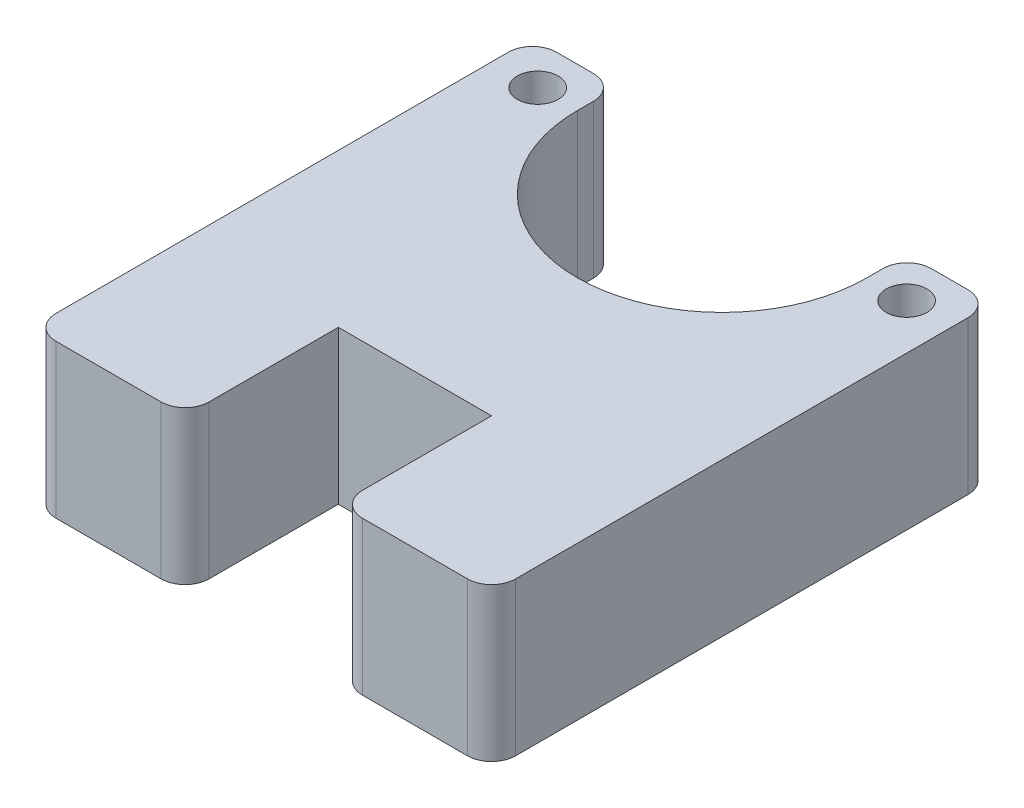
ISO-10303-21;
HEADER;
FILE_DESCRIPTION(('STEP AP214'),'2;1');
FILE_NAME('part.step','',(''),(''),'','','');
FILE_SCHEMA(('AUTOMOTIVE_DESIGN { 1 0 10303 214 1 1 1 1 }'));
ENDSEC;
DATA;
#1=APPLICATION_CONTEXT('core data for automotive mechanical design processes');
#2=APPLICATION_PROTOCOL_DEFINITION('international standard','automotive_design',2000,#1);
#3=PRODUCT_CONTEXT('',#1,'mechanical');
#4=PRODUCT('Part','Part','',(#3));
#5=PRODUCT_RELATED_PRODUCT_CATEGORY('part','',(#4));
#6=PRODUCT_DEFINITION_FORMATION('','',#4);
#7=PRODUCT_DEFINITION_CONTEXT('part definition',#1,'design');
#8=PRODUCT_DEFINITION('design','',#6,#7);
#9=PRODUCT_DEFINITION_SHAPE('','',#8);
#10=(LENGTH_UNIT() NAMED_UNIT(*) SI_UNIT(.MILLI.,.METRE.));
#11=(NAMED_UNIT(*) PLANE_ANGLE_UNIT() SI_UNIT($,.RADIAN.));
#12=(NAMED_UNIT(*) SI_UNIT($,.STERADIAN.) SOLID_ANGLE_UNIT());
#13=UNCERTAINTY_MEASURE_WITH_UNIT(LENGTH_MEASURE(1.E-05),#10,'distance_accuracy_value','');
#14=(GEOMETRIC_REPRESENTATION_CONTEXT(3) GLOBAL_UNCERTAINTY_ASSIGNED_CONTEXT((#13)) GLOBAL_UNIT_ASSIGNED_CONTEXT((#10,
#11,#12)) REPRESENTATION_CONTEXT('',''));
#15=CARTESIAN_POINT('',(0.,0.,0.));
#16=DIRECTION('',(0.,0.,1.));
#17=DIRECTION('',(1.,0.,0.));
#18=AXIS2_PLACEMENT_3D('',#15,#16,#17);
#19=CARTESIAN_POINT('',(19.05,6.35,0.));
#20=DIRECTION('',(-1.,0.,0.));
#21=DIRECTION('',(0.,0.,1.));
#22=AXIS2_PLACEMENT_3D('',#19,#20,#21);
#23=PLANE('',#22);
#24=DIRECTION('',(0.,0.,-1.));
#25=VECTOR('',#24,1.);
#26=CARTESIAN_POINT('',(19.05,6.35,0.));
#27=LINE('',#26,#25);
#28=CARTESIAN_POINT('',(19.05,6.35,5.35));
#29=VERTEX_POINT('',#28);
#30=CARTESIAN_POINT('',(19.05,6.35,-13.393729658));
#31=VERTEX_POINT('',#30);
#32=EDGE_CURVE('E268',#29,#31,#27,.T.);
#33=ORIENTED_EDGE('',*,*,#32,.F.);
#34=DIRECTION('',(0.,-1.,0.));
#35=VECTOR('',#34,1.);
#36=CARTESIAN_POINT('',(19.05,0.,5.35));
#37=LINE('',#36,#35);
#38=CARTESIAN_POINT('',(19.05,0.,5.35));
#39=VERTEX_POINT('',#38);
#40=EDGE_CURVE('E275',#29,#39,#37,.T.);
#41=ORIENTED_EDGE('',*,*,#40,.T.);
#42=DIRECTION('',(0.,0.,-1.));
#43=VECTOR('',#42,1.);
#44=CARTESIAN_POINT('',(19.05,0.,0.));
#45=LINE('',#44,#43);
#46=CARTESIAN_POINT('',(19.05,0.,-13.393729658));
#47=VERTEX_POINT('',#46);
#48=EDGE_CURVE('E231',#39,#47,#45,.T.);
#49=ORIENTED_EDGE('',*,*,#48,.T.);
#50=DIRECTION('',(0.,-1.,0.));
#51=VECTOR('',#50,1.);
#52=CARTESIAN_POINT('',(19.05,6.35,-13.393729658));
#53=LINE('',#52,#51);
#54=EDGE_CURVE('E186',#47,#31,#53,.F.);
#55=ORIENTED_EDGE('',*,*,#54,.T.);
#56=EDGE_LOOP('',(#33,#41,#49,#55));
#57=FACE_BOUND('',#56,.T.);
#58=ADVANCED_FACE('F34',(#57),#23,.F.);
#59=CARTESIAN_POINT('',(0.,6.35,-14.393729658));
#60=DIRECTION('',(0.,0.,1.));
#61=DIRECTION('',(1.,0.,0.));
#62=AXIS2_PLACEMENT_3D('',#59,#60,#61);
#63=PLANE('',#62);
#64=DIRECTION('',(-1.,0.,0.));
#65=VECTOR('',#64,1.);
#66=CARTESIAN_POINT('',(0.,6.35,-14.393729658));
#67=LINE('',#66,#65);
#68=CARTESIAN_POINT('',(18.05,6.35,-14.393729658));
#69=VERTEX_POINT('',#68);
#70=CARTESIAN_POINT('',(16.5250007,6.35,-14.393729658));
#71=VERTEX_POINT('',#70);
#72=EDGE_CURVE('E198',#69,#71,#67,.T.);
#73=ORIENTED_EDGE('',*,*,#72,.F.);
#74=DIRECTION('',(0.,-1.,0.));
#75=VECTOR('',#74,1.);
#76=CARTESIAN_POINT('',(18.05,6.35,-14.393729658));
#77=LINE('',#76,#75);
#78=CARTESIAN_POINT('',(18.05,0.,-14.393729658));
#79=VERTEX_POINT('',#78);
#80=EDGE_CURVE('E329',#69,#79,#77,.T.);
#81=ORIENTED_EDGE('',*,*,#80,.T.);
#82=DIRECTION('',(-1.,0.,0.));
#83=VECTOR('',#82,1.);
#84=CARTESIAN_POINT('',(0.,0.,-14.393729658));
#85=LINE('',#84,#83);
#86=CARTESIAN_POINT('',(16.5250007,0.,-14.393729658));
#87=VERTEX_POINT('',#86);
#88=EDGE_CURVE('E234',#79,#87,#85,.T.);
#89=ORIENTED_EDGE('',*,*,#88,.T.);
#90=DIRECTION('',(0.,-1.,0.));
#91=VECTOR('',#90,1.);
#92=CARTESIAN_POINT('',(16.5250007,6.35,-14.393729658));
#93=LINE('',#92,#91);
#94=EDGE_CURVE('E327',#87,#71,#93,.F.);
#95=ORIENTED_EDGE('',*,*,#94,.T.);
#96=EDGE_LOOP('',(#73,#81,#89,#95));
#97=FACE_BOUND('',#96,.T.);
#98=ADVANCED_FACE('F393',(#97),#63,.F.);
#99=CARTESIAN_POINT('',(15.5250007,6.35,0.));
#100=DIRECTION('',(-1.,0.,0.));
#101=DIRECTION('',(0.,0.,1.));
#102=AXIS2_PLACEMENT_3D('',#99,#100,#101);
#103=PLANE('',#102);
#104=DIRECTION('',(0.,0.,-1.));
#105=VECTOR('',#104,1.);
#106=CARTESIAN_POINT('',(15.5250007,6.35,0.));
#107=LINE('',#106,#105);
#108=CARTESIAN_POINT('',(15.5250007,6.35,-12.7287274));
#109=VERTEX_POINT('',#108);
#110=CARTESIAN_POINT('',(15.5250007,6.35,-13.393729658));
#111=VERTEX_POINT('',#110);
#112=EDGE_CURVE('E178',#109,#111,#107,.T.);
#113=ORIENTED_EDGE('',*,*,#112,.T.);
#114=DIRECTION('',(0.,-1.,0.));
#115=VECTOR('',#114,1.);
#116=CARTESIAN_POINT('',(15.5250007,0.,-13.393729658));
#117=LINE('',#116,#115);
#118=CARTESIAN_POINT('',(15.5250007,0.,-13.393729658));
#119=VERTEX_POINT('',#118);
#120=EDGE_CURVE('E332',#111,#119,#117,.T.);
#121=ORIENTED_EDGE('',*,*,#120,.T.);
#122=DIRECTION('',(0.,0.,-1.));
#123=VECTOR('',#122,1.);
#124=CARTESIAN_POINT('',(15.5250007,0.,0.));
#125=LINE('',#124,#123);
#126=CARTESIAN_POINT('',(15.5250007,0.,-12.7287274));
#127=VERTEX_POINT('',#126);
#128=EDGE_CURVE('E181',#127,#119,#125,.T.);
#129=ORIENTED_EDGE('',*,*,#128,.F.);
#130=DIRECTION('',(0.,-1.,0.));
#131=VECTOR('',#130,1.);
#132=CARTESIAN_POINT('',(15.5250007,6.35,-12.7287274));
#133=LINE('',#132,#131);
#134=EDGE_CURVE('E174',#109,#127,#133,.T.);
#135=ORIENTED_EDGE('',*,*,#134,.F.);
#136=EDGE_LOOP('',(#113,#121,#129,#135));
#137=FACE_BOUND('',#136,.T.);
#138=ADVANCED_FACE('F176',(#137),#103,.T.);
#139=CARTESIAN_POINT('',(9.525,6.35,-12.7287274));
#140=DIRECTION('',(0.,-1.,0.));
#141=DIRECTION('',(0.,0.,-1.));
#142=AXIS2_PLACEMENT_3D('',#139,#140,#141);
#143=CYLINDRICAL_SURFACE('',#142,6.0000007);
#144=CARTESIAN_POINT('',(9.525,0.,-12.7287274));
#145=DIRECTION('',(0.,1.,0.));
#146=DIRECTION('',(0.,0.,1.));
#147=AXIS2_PLACEMENT_3D('',#144,#145,#146);
#148=CIRCLE('',#147,6.0000007);
#149=CARTESIAN_POINT('',(3.52499930000392,0.,-12.7287274));
#150=VERTEX_POINT('',#149);
#151=EDGE_CURVE('E238',#150,#127,#148,.T.);
#152=ORIENTED_EDGE('',*,*,#151,.F.);
#153=DIRECTION('',(0.,-1.,0.));
#154=VECTOR('',#153,1.);
#155=CARTESIAN_POINT('',(3.52499930000392,6.35,-12.7287274));
#156=LINE('',#155,#154);
#157=CARTESIAN_POINT('',(3.52499930000392,6.35,-12.7287274));
#158=VERTEX_POINT('',#157);
#159=EDGE_CURVE('E187',#158,#150,#156,.T.);
#160=ORIENTED_EDGE('',*,*,#159,.F.);
#161=CARTESIAN_POINT('',(9.525,6.35,-12.7287274));
#162=DIRECTION('',(0.,1.,0.));
#163=DIRECTION('',(0.,0.,1.));
#164=AXIS2_PLACEMENT_3D('',#161,#162,#163);
#165=CIRCLE('',#164,6.0000007);
#166=EDGE_CURVE('E194',#158,#109,#165,.T.);
#167=ORIENTED_EDGE('',*,*,#166,.T.);
#168=ORIENTED_EDGE('',*,*,#134,.T.);
#169=EDGE_LOOP('',(#152,#160,#167,#168));
#170=FACE_BOUND('',#169,.T.);
#171=ADVANCED_FACE('F200',(#170),#143,.F.);
#172=CARTESIAN_POINT('',(3.52499930000392,6.35,0.));
#173=DIRECTION('',(-1.,0.,0.));
#174=DIRECTION('',(0.,0.,1.));
#175=AXIS2_PLACEMENT_3D('',#172,#173,#174);
#176=PLANE('',#175);
#177=DIRECTION('',(0.,0.,-1.));
#178=VECTOR('',#177,1.);
#179=CARTESIAN_POINT('',(3.52499930000392,0.,0.));
#180=LINE('',#179,#178);
#181=CARTESIAN_POINT('',(3.52499930000392,0.,-13.393729658));
#182=VERTEX_POINT('',#181);
#183=EDGE_CURVE('E240',#150,#182,#180,.T.);
#184=ORIENTED_EDGE('',*,*,#183,.T.);
#185=DIRECTION('',(0.,-1.,0.));
#186=VECTOR('',#185,1.);
#187=CARTESIAN_POINT('',(3.52499930000392,6.35,-13.393729658));
#188=LINE('',#187,#186);
#189=CARTESIAN_POINT('',(3.52499930000392,6.35,-13.393729658));
#190=VERTEX_POINT('',#189);
#191=EDGE_CURVE('E11',#182,#190,#188,.F.);
#192=ORIENTED_EDGE('',*,*,#191,.T.);
#193=DIRECTION('',(0.,0.,-1.));
#194=VECTOR('',#193,1.);
#195=CARTESIAN_POINT('',(3.52499930000392,6.35,0.));
#196=LINE('',#195,#194);
#197=EDGE_CURVE('E202',#158,#190,#196,.T.);
#198=ORIENTED_EDGE('',*,*,#197,.F.);
#199=ORIENTED_EDGE('',*,*,#159,.T.);
#200=EDGE_LOOP('',(#184,#192,#198,#199));
#201=FACE_BOUND('',#200,.T.);
#202=ADVANCED_FACE('F430',(#201),#176,.F.);
#203=CARTESIAN_POINT('',(0.,6.35,-14.393729658));
#204=DIRECTION('',(0.,0.,-1.));
#205=DIRECTION('',(-1.,0.,0.));
#206=AXIS2_PLACEMENT_3D('',#203,#204,#205);
#207=PLANE('',#206);
#208=DIRECTION('',(1.,0.,0.));
#209=VECTOR('',#208,1.);
#210=CARTESIAN_POINT('',(0.,6.35,-14.393729658));
#211=LINE('',#210,#209);
#212=CARTESIAN_POINT('',(1.,6.35,-14.393729658));
#213=VERTEX_POINT('',#212);
#214=CARTESIAN_POINT('',(2.52499930000392,6.35,-14.393729658));
#215=VERTEX_POINT('',#214);
#216=EDGE_CURVE('E204',#213,#215,#211,.T.);
#217=ORIENTED_EDGE('',*,*,#216,.T.);
#218=DIRECTION('',(0.,-1.,0.));
#219=VECTOR('',#218,1.);
#220=CARTESIAN_POINT('',(2.52499930000392,0.,-14.393729658));
#221=LINE('',#220,#219);
#222=CARTESIAN_POINT('',(2.52499930000392,0.,-14.393729658));
#223=VERTEX_POINT('',#222);
#224=EDGE_CURVE('E42',#215,#223,#221,.T.);
#225=ORIENTED_EDGE('',*,*,#224,.T.);
#226=DIRECTION('',(1.,0.,0.));
#227=VECTOR('',#226,1.);
#228=CARTESIAN_POINT('',(0.,0.,-14.393729658));
#229=LINE('',#228,#227);
#230=CARTESIAN_POINT('',(1.,0.,-14.393729658));
#231=VERTEX_POINT('',#230);
#232=EDGE_CURVE('E243',#231,#223,#229,.T.);
#233=ORIENTED_EDGE('',*,*,#232,.F.);
#234=DIRECTION('',(0.,-1.,0.));
#235=VECTOR('',#234,1.);
#236=CARTESIAN_POINT('',(1.,6.35,-14.393729658));
#237=LINE('',#236,#235);
#238=EDGE_CURVE('E334',#231,#213,#237,.F.);
#239=ORIENTED_EDGE('',*,*,#238,.T.);
#240=EDGE_LOOP('',(#217,#225,#233,#239));
#241=FACE_BOUND('',#240,.T.);
#242=ADVANCED_FACE('F339',(#241),#207,.T.);
#243=CARTESIAN_POINT('',(0.,6.35,0.));
#244=DIRECTION('',(-1.,0.,0.));
#245=DIRECTION('',(0.,0.,1.));
#246=AXIS2_PLACEMENT_3D('',#243,#244,#245);
#247=PLANE('',#246);
#248=DIRECTION('',(0.,0.,-1.));
#249=VECTOR('',#248,1.);
#250=CARTESIAN_POINT('',(0.,0.,0.));
#251=LINE('',#250,#249);
#252=CARTESIAN_POINT('',(0.,0.,5.35));
#253=VERTEX_POINT('',#252);
#254=CARTESIAN_POINT('',(0.,0.,-13.393729658));
#255=VERTEX_POINT('',#254);
#256=EDGE_CURVE('E246',#253,#255,#251,.T.);
#257=ORIENTED_EDGE('',*,*,#256,.F.);
#258=DIRECTION('',(0.,-1.,0.));
#259=VECTOR('',#258,1.);
#260=CARTESIAN_POINT('',(0.,6.35,5.35));
#261=LINE('',#260,#259);
#262=CARTESIAN_POINT('',(0.,6.35,5.35));
#263=VERTEX_POINT('',#262);
#264=EDGE_CURVE('E325',#253,#263,#261,.F.);
#265=ORIENTED_EDGE('',*,*,#264,.T.);
#266=DIRECTION('',(0.,0.,-1.));
#267=VECTOR('',#266,1.);
#268=CARTESIAN_POINT('',(0.,6.35,0.));
#269=LINE('',#268,#267);
#270=CARTESIAN_POINT('',(0.,6.35,-13.393729658));
#271=VERTEX_POINT('',#270);
#272=EDGE_CURVE('E210',#263,#271,#269,.T.);
#273=ORIENTED_EDGE('',*,*,#272,.T.);
#274=DIRECTION('',(0.,-1.,0.));
#275=VECTOR('',#274,1.);
#276=CARTESIAN_POINT('',(0.,6.35,-13.393729658));
#277=LINE('',#276,#275);
#278=EDGE_CURVE('E322',#271,#255,#277,.T.);
#279=ORIENTED_EDGE('',*,*,#278,.T.);
#280=EDGE_LOOP('',(#257,#265,#273,#279));
#281=FACE_BOUND('',#280,.T.);
#282=ADVANCED_FACE('F354',(#281),#247,.T.);
#283=CARTESIAN_POINT('',(0.,6.35,6.35));
#284=DIRECTION('',(0.,0.,-1.));
#285=DIRECTION('',(-1.,0.,0.));
#286=AXIS2_PLACEMENT_3D('',#283,#284,#285);
#287=PLANE('',#286);
#288=DIRECTION('',(1.,0.,0.));
#289=VECTOR('',#288,1.);
#290=CARTESIAN_POINT('',(0.,0.,6.35));
#291=LINE('',#290,#289);
#292=CARTESIAN_POINT('',(0.999999999999992,0.,6.35));
#293=VERTEX_POINT('',#292);
#294=CARTESIAN_POINT('',(5.35,0.,6.35));
#295=VERTEX_POINT('',#294);
#296=EDGE_CURVE('E249',#293,#295,#291,.T.);
#297=ORIENTED_EDGE('',*,*,#296,.T.);
#298=DIRECTION('',(0.,-1.,0.));
#299=VECTOR('',#298,1.);
#300=CARTESIAN_POINT('',(5.35,6.35,6.35));
#301=LINE('',#300,#299);
#302=CARTESIAN_POINT('',(5.35,6.35,6.35));
#303=VERTEX_POINT('',#302);
#304=EDGE_CURVE('E320',#295,#303,#301,.F.);
#305=ORIENTED_EDGE('',*,*,#304,.T.);
#306=DIRECTION('',(1.,0.,0.));
#307=VECTOR('',#306,1.);
#308=CARTESIAN_POINT('',(0.,6.35,6.35));
#309=LINE('',#308,#307);
#310=CARTESIAN_POINT('',(0.999999999999992,6.35,6.35));
#311=VERTEX_POINT('',#310);
#312=EDGE_CURVE('E213',#311,#303,#309,.T.);
#313=ORIENTED_EDGE('',*,*,#312,.F.);
#314=DIRECTION('',(0.,-1.,0.));
#315=VECTOR('',#314,1.);
#316=CARTESIAN_POINT('',(0.999999999999992,0.,6.35));
#317=LINE('',#316,#315);
#318=EDGE_CURVE('E317',#311,#293,#317,.T.);
#319=ORIENTED_EDGE('',*,*,#318,.T.);
#320=EDGE_LOOP('',(#297,#305,#313,#319));
#321=FACE_BOUND('',#320,.T.);
#322=ADVANCED_FACE('F364',(#321),#287,.F.);
#323=CARTESIAN_POINT('',(6.35,6.35,0.));
#324=DIRECTION('',(1.,0.,0.));
#325=DIRECTION('',(0.,0.,-1.));
#326=AXIS2_PLACEMENT_3D('',#323,#324,#325);
#327=PLANE('',#326);
#328=DIRECTION('',(0.,0.,1.));
#329=VECTOR('',#328,1.);
#330=CARTESIAN_POINT('',(6.35,6.35,0.));
#331=LINE('',#330,#329);
#332=CARTESIAN_POINT('',(6.35,6.35,0.));
#333=VERTEX_POINT('',#332);
#334=CARTESIAN_POINT('',(6.35,6.35,5.35));
#335=VERTEX_POINT('',#334);
#336=EDGE_CURVE('E215',#333,#335,#331,.T.);
#337=ORIENTED_EDGE('',*,*,#336,.T.);
#338=DIRECTION('',(0.,-1.,0.));
#339=VECTOR('',#338,1.);
#340=CARTESIAN_POINT('',(6.35,0.,5.35));
#341=LINE('',#340,#339);
#342=CARTESIAN_POINT('',(6.35,0.,5.35));
#343=VERTEX_POINT('',#342);
#344=EDGE_CURVE('E314',#335,#343,#341,.T.);
#345=ORIENTED_EDGE('',*,*,#344,.T.);
#346=DIRECTION('',(0.,0.,1.));
#347=VECTOR('',#346,1.);
#348=CARTESIAN_POINT('',(6.35,0.,0.));
#349=LINE('',#348,#347);
#350=CARTESIAN_POINT('',(6.35,0.,0.));
#351=VERTEX_POINT('',#350);
#352=EDGE_CURVE('E252',#351,#343,#349,.T.);
#353=ORIENTED_EDGE('',*,*,#352,.F.);
#354=DIRECTION('',(0.,-1.,0.));
#355=VECTOR('',#354,1.);
#356=CARTESIAN_POINT('',(6.35,6.35,0.));
#357=LINE('',#356,#355);
#358=EDGE_CURVE('E271',#333,#351,#357,.T.);
#359=ORIENTED_EDGE('',*,*,#358,.F.);
#360=EDGE_LOOP('',(#337,#345,#353,#359));
#361=FACE_BOUND('',#360,.T.);
#362=ADVANCED_FACE('F372',(#361),#327,.T.);
#363=CARTESIAN_POINT('',(0.,6.35,0.));
#364=DIRECTION('',(0.,0.,-1.));
#365=DIRECTION('',(-1.,0.,0.));
#366=AXIS2_PLACEMENT_3D('',#363,#364,#365);
#367=PLANE('',#366);
#368=DIRECTION('',(1.,0.,0.));
#369=VECTOR('',#368,1.);
#370=CARTESIAN_POINT('',(0.,0.,0.));
#371=LINE('',#370,#369);
#372=CARTESIAN_POINT('',(12.7,0.,0.));
#373=VERTEX_POINT('',#372);
#374=EDGE_CURVE('E255',#351,#373,#371,.T.);
#375=ORIENTED_EDGE('',*,*,#374,.T.);
#376=DIRECTION('',(0.,-1.,0.));
#377=VECTOR('',#376,1.);
#378=CARTESIAN_POINT('',(12.7,6.35,0.));
#379=LINE('',#378,#377);
#380=CARTESIAN_POINT('',(12.7,6.35,0.));
#381=VERTEX_POINT('',#380);
#382=EDGE_CURVE('E230',#381,#373,#379,.T.);
#383=ORIENTED_EDGE('',*,*,#382,.F.);
#384=DIRECTION('',(1.,0.,0.));
#385=VECTOR('',#384,1.);
#386=CARTESIAN_POINT('',(0.,6.35,0.));
#387=LINE('',#386,#385);
#388=EDGE_CURVE('E217',#333,#381,#387,.T.);
#389=ORIENTED_EDGE('',*,*,#388,.F.);
#390=ORIENTED_EDGE('',*,*,#358,.T.);
#391=EDGE_LOOP('',(#375,#383,#389,#390));
#392=FACE_BOUND('',#391,.T.);
#393=ADVANCED_FACE('F377',(#392),#367,.F.);
#394=CARTESIAN_POINT('',(12.7,6.35,0.));
#395=DIRECTION('',(1.,0.,0.));
#396=DIRECTION('',(0.,0.,-1.));
#397=AXIS2_PLACEMENT_3D('',#394,#395,#396);
#398=PLANE('',#397);
#399=DIRECTION('',(0.,0.,1.));
#400=VECTOR('',#399,1.);
#401=CARTESIAN_POINT('',(12.7,0.,0.));
#402=LINE('',#401,#400);
#403=CARTESIAN_POINT('',(12.7,0.,5.35));
#404=VERTEX_POINT('',#403);
#405=EDGE_CURVE('E257',#373,#404,#402,.T.);
#406=ORIENTED_EDGE('',*,*,#405,.T.);
#407=DIRECTION('',(0.,-1.,0.));
#408=VECTOR('',#407,1.);
#409=CARTESIAN_POINT('',(12.7,6.35,5.35));
#410=LINE('',#409,#408);
#411=CARTESIAN_POINT('',(12.7,6.35,5.35));
#412=VERTEX_POINT('',#411);
#413=EDGE_CURVE('E49',#404,#412,#410,.F.);
#414=ORIENTED_EDGE('',*,*,#413,.T.);
#415=DIRECTION('',(0.,0.,1.));
#416=VECTOR('',#415,1.);
#417=CARTESIAN_POINT('',(12.7,6.35,0.));
#418=LINE('',#417,#416);
#419=EDGE_CURVE('E219',#381,#412,#418,.T.);
#420=ORIENTED_EDGE('',*,*,#419,.F.);
#421=ORIENTED_EDGE('',*,*,#382,.T.);
#422=EDGE_LOOP('',(#406,#414,#420,#421));
#423=FACE_BOUND('',#422,.T.);
#424=ADVANCED_FACE('F379',(#423),#398,.F.);
#425=CARTESIAN_POINT('',(1.88250068000392,6.35,-12.728734258));
#426=DIRECTION('',(0.,-1.,0.));
#427=DIRECTION('',(0.,0.,-1.));
#428=AXIS2_PLACEMENT_3D('',#425,#426,#427);
#429=CYLINDRICAL_SURFACE('',#428,0.8449945);
#430=CARTESIAN_POINT('',(1.88250068000392,6.35,-12.728734258));
#431=DIRECTION('',(0.,1.,0.));
#432=DIRECTION('',(0.,0.,1.));
#433=AXIS2_PLACEMENT_3D('',#430,#431,#432);
#434=CIRCLE('',#433,0.8449945);
#435=CARTESIAN_POINT('',(1.88250068000392,6.35,-11.883739758));
#436=VERTEX_POINT('',#435);
#437=EDGE_CURVE('E224',#436,#436,#434,.T.);
#438=ORIENTED_EDGE('',*,*,#437,.T.);
#439=EDGE_LOOP('',(#438));
#440=FACE_BOUND('',#439,.T.);
#441=CARTESIAN_POINT('',(1.88250068000392,0.,-12.728734258));
#442=DIRECTION('',(0.,1.,0.));
#443=DIRECTION('',(0.,0.,1.));
#444=AXIS2_PLACEMENT_3D('',#441,#442,#443);
#445=CIRCLE('',#444,0.8449945);
#446=CARTESIAN_POINT('',(1.88250068000392,0.,-11.883739758));
#447=VERTEX_POINT('',#446);
#448=EDGE_CURVE('E262',#447,#447,#445,.T.);
#449=ORIENTED_EDGE('',*,*,#448,.F.);
#450=EDGE_LOOP('',(#449));
#451=FACE_BOUND('',#450,.T.);
#452=ADVANCED_FACE('F381',(#440,#451),#429,.F.);
#453=CARTESIAN_POINT('',(0.,6.35,6.35));
#454=DIRECTION('',(0.,0.,1.));
#455=DIRECTION('',(1.,0.,0.));
#456=AXIS2_PLACEMENT_3D('',#453,#454,#455);
#457=PLANE('',#456);
#458=DIRECTION('',(-1.,0.,0.));
#459=VECTOR('',#458,1.);
#460=CARTESIAN_POINT('',(0.,0.,6.35));
#461=LINE('',#460,#459);
#462=CARTESIAN_POINT('',(18.05,0.,6.35));
#463=VERTEX_POINT('',#462);
#464=CARTESIAN_POINT('',(13.7,0.,6.35));
#465=VERTEX_POINT('',#464);
#466=EDGE_CURVE('E259',#463,#465,#461,.T.);
#467=ORIENTED_EDGE('',*,*,#466,.F.);
#468=DIRECTION('',(0.,-1.,0.));
#469=VECTOR('',#468,1.);
#470=CARTESIAN_POINT('',(18.05,6.35,6.35));
#471=LINE('',#470,#469);
#472=CARTESIAN_POINT('',(18.05,6.35,6.35));
#473=VERTEX_POINT('',#472);
#474=EDGE_CURVE('E297',#463,#473,#471,.F.);
#475=ORIENTED_EDGE('',*,*,#474,.T.);
#476=DIRECTION('',(-1.,0.,0.));
#477=VECTOR('',#476,1.);
#478=CARTESIAN_POINT('',(0.,6.35,6.35));
#479=LINE('',#478,#477);
#480=CARTESIAN_POINT('',(13.7,6.35,6.35));
#481=VERTEX_POINT('',#480);
#482=EDGE_CURVE('E221',#473,#481,#479,.T.);
#483=ORIENTED_EDGE('',*,*,#482,.T.);
#484=DIRECTION('',(0.,-1.,0.));
#485=VECTOR('',#484,1.);
#486=CARTESIAN_POINT('',(13.7,0.,6.35));
#487=LINE('',#486,#485);
#488=EDGE_CURVE('E294',#481,#465,#487,.T.);
#489=ORIENTED_EDGE('',*,*,#488,.T.);
#490=EDGE_LOOP('',(#467,#475,#483,#489));
#491=FACE_BOUND('',#490,.T.);
#492=ADVANCED_FACE('F387',(#491),#457,.T.);
#493=CARTESIAN_POINT('',(17.16749932,6.35,-12.7287274));
#494=DIRECTION('',(0.,-1.,0.));
#495=DIRECTION('',(0.,0.,-1.));
#496=AXIS2_PLACEMENT_3D('',#493,#494,#495);
#497=CYLINDRICAL_SURFACE('',#496,0.844994500000003);
#498=CARTESIAN_POINT('',(17.16749932,6.35,-12.7287274));
#499=DIRECTION('',(0.,1.,0.));
#500=DIRECTION('',(0.,0.,1.));
#501=AXIS2_PLACEMENT_3D('',#498,#499,#500);
#502=CIRCLE('',#501,0.844994500000003);
#503=CARTESIAN_POINT('',(17.16749932,6.35,-11.8837329));
#504=VERTEX_POINT('',#503);
#505=EDGE_CURVE('E227',#504,#504,#502,.T.);
#506=ORIENTED_EDGE('',*,*,#505,.T.);
#507=EDGE_LOOP('',(#506));
#508=FACE_BOUND('',#507,.T.);
#509=CARTESIAN_POINT('',(17.16749932,0.,-12.7287274));
#510=DIRECTION('',(0.,1.,0.));
#511=DIRECTION('',(0.,0.,1.));
#512=AXIS2_PLACEMENT_3D('',#509,#510,#511);
#513=CIRCLE('',#512,0.844994500000003);
#514=CARTESIAN_POINT('',(17.16749932,0.,-11.8837329));
#515=VERTEX_POINT('',#514);
#516=EDGE_CURVE('E265',#515,#515,#513,.T.);
#517=ORIENTED_EDGE('',*,*,#516,.F.);
#518=EDGE_LOOP('',(#517));
#519=FACE_BOUND('',#518,.T.);
#520=ADVANCED_FACE('F446',(#508,#519),#497,.F.);
#521=CARTESIAN_POINT('',(0.,6.35,0.));
#522=DIRECTION('',(0.,1.,0.));
#523=DIRECTION('',(0.,0.,1.));
#524=AXIS2_PLACEMENT_3D('',#521,#522,#523);
#525=PLANE('',#524);
#526=ORIENTED_EDGE('',*,*,#482,.F.);
#527=CARTESIAN_POINT('',(18.05,6.35,5.35));
#528=DIRECTION('',(0.,1.,0.));
#529=DIRECTION('',(0.,0.,1.));
#530=AXIS2_PLACEMENT_3D('',#527,#528,#529);
#531=CIRCLE('',#530,1.);
#532=EDGE_CURVE('E311',#473,#29,#531,.T.);
#533=ORIENTED_EDGE('',*,*,#532,.T.);
#534=ORIENTED_EDGE('',*,*,#32,.T.);
#535=CARTESIAN_POINT('',(18.05,6.35,-13.393729658));
#536=DIRECTION('',(0.,1.,0.));
#537=DIRECTION('',(0.,0.,1.));
#538=AXIS2_PLACEMENT_3D('',#535,#536,#537);
#539=CIRCLE('',#538,1.);
#540=EDGE_CURVE('E304',#31,#69,#539,.T.);
#541=ORIENTED_EDGE('',*,*,#540,.T.);
#542=ORIENTED_EDGE('',*,*,#72,.T.);
#543=CARTESIAN_POINT('',(16.5250007,6.35,-13.393729658));
#544=DIRECTION('',(0.,1.,0.));
#545=DIRECTION('',(0.,0.,1.));
#546=AXIS2_PLACEMENT_3D('',#543,#544,#545);
#547=CIRCLE('',#546,1.);
#548=EDGE_CURVE('E197',#71,#111,#547,.T.);
#549=ORIENTED_EDGE('',*,*,#548,.T.);
#550=ORIENTED_EDGE('',*,*,#112,.F.);
#551=ORIENTED_EDGE('',*,*,#166,.F.);
#552=ORIENTED_EDGE('',*,*,#197,.T.);
#553=CARTESIAN_POINT('',(2.52499930000392,6.35,-13.393729658));
#554=DIRECTION('',(0.,1.,0.));
#555=DIRECTION('',(0.,0.,1.));
#556=AXIS2_PLACEMENT_3D('',#553,#554,#555);
#557=CIRCLE('',#556,1.);
#558=EDGE_CURVE('E301',#190,#215,#557,.T.);
#559=ORIENTED_EDGE('',*,*,#558,.T.);
#560=ORIENTED_EDGE('',*,*,#216,.F.);
#561=CARTESIAN_POINT('',(1.,6.35,-13.393729658));
#562=DIRECTION('',(0.,1.,0.));
#563=DIRECTION('',(0.,0.,1.));
#564=AXIS2_PLACEMENT_3D('',#561,#562,#563);
#565=CIRCLE('',#564,1.);
#566=EDGE_CURVE('E299',#213,#271,#565,.T.);
#567=ORIENTED_EDGE('',*,*,#566,.T.);
#568=ORIENTED_EDGE('',*,*,#272,.F.);
#569=CARTESIAN_POINT('',(0.999999999999992,6.35,5.35));
#570=DIRECTION('',(0.,1.,0.));
#571=DIRECTION('',(0.,0.,1.));
#572=AXIS2_PLACEMENT_3D('',#569,#570,#571);
#573=CIRCLE('',#572,1.);
#574=EDGE_CURVE('E306',#263,#311,#573,.T.);
#575=ORIENTED_EDGE('',*,*,#574,.T.);
#576=ORIENTED_EDGE('',*,*,#312,.T.);
#577=CARTESIAN_POINT('',(5.35,6.35,5.35));
#578=DIRECTION('',(0.,1.,0.));
#579=DIRECTION('',(0.,0.,1.));
#580=AXIS2_PLACEMENT_3D('',#577,#578,#579);
#581=CIRCLE('',#580,1.);
#582=EDGE_CURVE('E57',#303,#335,#581,.T.);
#583=ORIENTED_EDGE('',*,*,#582,.T.);
#584=ORIENTED_EDGE('',*,*,#336,.F.);
#585=ORIENTED_EDGE('',*,*,#388,.T.);
#586=ORIENTED_EDGE('',*,*,#419,.T.);
#587=CARTESIAN_POINT('',(13.7,6.35,5.35));
#588=DIRECTION('',(0.,1.,0.));
#589=DIRECTION('',(0.,0.,1.));
#590=AXIS2_PLACEMENT_3D('',#587,#588,#589);
#591=CIRCLE('',#590,1.);
#592=EDGE_CURVE('E309',#412,#481,#591,.T.);
#593=ORIENTED_EDGE('',*,*,#592,.T.);
#594=EDGE_LOOP('',(#526,#533,#534,#541,#542,#549,#550,#551,#552,#559,#560,#567,#568,#575,#576,
#583,#584,#585,#586,#593));
#595=FACE_BOUND('',#594,.T.);
#596=ORIENTED_EDGE('',*,*,#437,.F.);
#597=EDGE_LOOP('',(#596));
#598=FACE_BOUND('',#597,.T.);
#599=ORIENTED_EDGE('',*,*,#505,.F.);
#600=EDGE_LOOP('',(#599));
#601=FACE_BOUND('',#600,.T.);
#602=ADVANCED_FACE('F191',(#595,#598,#601),#525,.T.);
#603=CARTESIAN_POINT('',(0.,0.,0.));
#604=DIRECTION('',(0.,1.,0.));
#605=DIRECTION('',(0.,0.,1.));
#606=AXIS2_PLACEMENT_3D('',#603,#604,#605);
#607=PLANE('',#606);
#608=ORIENTED_EDGE('',*,*,#48,.F.);
#609=CARTESIAN_POINT('',(18.05,0.,5.35));
#610=DIRECTION('',(0.,1.,0.));
#611=DIRECTION('',(0.,0.,1.));
#612=AXIS2_PLACEMENT_3D('',#609,#610,#611);
#613=CIRCLE('',#612,1.);
#614=EDGE_CURVE('E292',#39,#463,#613,.F.);
#615=ORIENTED_EDGE('',*,*,#614,.T.);
#616=ORIENTED_EDGE('',*,*,#466,.T.);
#617=CARTESIAN_POINT('',(13.7,0.,5.35));
#618=DIRECTION('',(0.,1.,0.));
#619=DIRECTION('',(0.,0.,1.));
#620=AXIS2_PLACEMENT_3D('',#617,#618,#619);
#621=CIRCLE('',#620,1.);
#622=EDGE_CURVE('E290',#465,#404,#621,.F.);
#623=ORIENTED_EDGE('',*,*,#622,.T.);
#624=ORIENTED_EDGE('',*,*,#405,.F.);
#625=ORIENTED_EDGE('',*,*,#374,.F.);
#626=ORIENTED_EDGE('',*,*,#352,.T.);
#627=CARTESIAN_POINT('',(5.35,0.,5.35));
#628=DIRECTION('',(0.,1.,0.));
#629=DIRECTION('',(0.,0.,1.));
#630=AXIS2_PLACEMENT_3D('',#627,#628,#629);
#631=CIRCLE('',#630,1.);
#632=EDGE_CURVE('E288',#343,#295,#631,.F.);
#633=ORIENTED_EDGE('',*,*,#632,.T.);
#634=ORIENTED_EDGE('',*,*,#296,.F.);
#635=CARTESIAN_POINT('',(0.999999999999992,0.,5.35));
#636=DIRECTION('',(0.,1.,0.));
#637=DIRECTION('',(0.,0.,1.));
#638=AXIS2_PLACEMENT_3D('',#635,#636,#637);
#639=CIRCLE('',#638,1.);
#640=EDGE_CURVE('E286',#293,#253,#639,.F.);
#641=ORIENTED_EDGE('',*,*,#640,.T.);
#642=ORIENTED_EDGE('',*,*,#256,.T.);
#643=CARTESIAN_POINT('',(1.,0.,-13.393729658));
#644=DIRECTION('',(0.,1.,0.));
#645=DIRECTION('',(0.,0.,1.));
#646=AXIS2_PLACEMENT_3D('',#643,#644,#645);
#647=CIRCLE('',#646,1.);
#648=EDGE_CURVE('E278',#255,#231,#647,.F.);
#649=ORIENTED_EDGE('',*,*,#648,.T.);
#650=ORIENTED_EDGE('',*,*,#232,.T.);
#651=CARTESIAN_POINT('',(2.52499930000392,0.,-13.393729658));
#652=DIRECTION('',(0.,1.,0.));
#653=DIRECTION('',(0.,0.,1.));
#654=AXIS2_PLACEMENT_3D('',#651,#652,#653);
#655=CIRCLE('',#654,1.);
#656=EDGE_CURVE('E280',#223,#182,#655,.F.);
#657=ORIENTED_EDGE('',*,*,#656,.T.);
#658=ORIENTED_EDGE('',*,*,#183,.F.);
#659=ORIENTED_EDGE('',*,*,#151,.T.);
#660=ORIENTED_EDGE('',*,*,#128,.T.);
#661=CARTESIAN_POINT('',(16.5250007,0.,-13.393729658));
#662=DIRECTION('',(0.,1.,0.));
#663=DIRECTION('',(0.,0.,1.));
#664=AXIS2_PLACEMENT_3D('',#661,#662,#663);
#665=CIRCLE('',#664,1.);
#666=EDGE_CURVE('E282',#119,#87,#665,.F.);
#667=ORIENTED_EDGE('',*,*,#666,.T.);
#668=ORIENTED_EDGE('',*,*,#88,.F.);
#669=CARTESIAN_POINT('',(18.05,0.,-13.393729658));
#670=DIRECTION('',(0.,1.,0.));
#671=DIRECTION('',(0.,0.,1.));
#672=AXIS2_PLACEMENT_3D('',#669,#670,#671);
#673=CIRCLE('',#672,1.);
#674=EDGE_CURVE('E284',#79,#47,#673,.F.);
#675=ORIENTED_EDGE('',*,*,#674,.T.);
#676=EDGE_LOOP('',(#608,#615,#616,#623,#624,#625,#626,#633,#634,#641,#642,#649,#650,#657,#658,
#659,#660,#667,#668,#675));
#677=FACE_BOUND('',#676,.T.);
#678=ORIENTED_EDGE('',*,*,#448,.T.);
#679=EDGE_LOOP('',(#678));
#680=FACE_BOUND('',#679,.T.);
#681=ORIENTED_EDGE('',*,*,#516,.T.);
#682=EDGE_LOOP('',(#681));
#683=FACE_BOUND('',#682,.T.);
#684=ADVANCED_FACE('F346',(#677,#680,#683),#607,.F.);
#685=CARTESIAN_POINT('',(18.05,6.35,5.35));
#686=DIRECTION('',(0.,1.,0.));
#687=DIRECTION('',(0.,0.,1.));
#688=AXIS2_PLACEMENT_3D('',#685,#686,#687);
#689=CYLINDRICAL_SURFACE('',#688,1.);
#690=ORIENTED_EDGE('',*,*,#532,.F.);
#691=ORIENTED_EDGE('',*,*,#474,.F.);
#692=ORIENTED_EDGE('',*,*,#614,.F.);
#693=ORIENTED_EDGE('',*,*,#40,.F.);
#694=EDGE_LOOP('',(#690,#691,#692,#693));
#695=FACE_BOUND('',#694,.T.);
#696=ADVANCED_FACE('F404',(#695),#689,.T.);
#697=CARTESIAN_POINT('',(13.7,6.35,5.35));
#698=DIRECTION('',(0.,1.,0.));
#699=DIRECTION('',(0.,0.,1.));
#700=AXIS2_PLACEMENT_3D('',#697,#698,#699);
#701=CYLINDRICAL_SURFACE('',#700,1.);
#702=ORIENTED_EDGE('',*,*,#592,.F.);
#703=ORIENTED_EDGE('',*,*,#413,.F.);
#704=ORIENTED_EDGE('',*,*,#622,.F.);
#705=ORIENTED_EDGE('',*,*,#488,.F.);
#706=EDGE_LOOP('',(#702,#703,#704,#705));
#707=FACE_BOUND('',#706,.T.);
#708=ADVANCED_FACE('F407',(#707),#701,.T.);
#709=CARTESIAN_POINT('',(5.35,6.35,5.35));
#710=DIRECTION('',(0.,1.,0.));
#711=DIRECTION('',(0.,0.,1.));
#712=AXIS2_PLACEMENT_3D('',#709,#710,#711);
#713=CYLINDRICAL_SURFACE('',#712,1.);
#714=ORIENTED_EDGE('',*,*,#582,.F.);
#715=ORIENTED_EDGE('',*,*,#304,.F.);
#716=ORIENTED_EDGE('',*,*,#632,.F.);
#717=ORIENTED_EDGE('',*,*,#344,.F.);
#718=EDGE_LOOP('',(#714,#715,#716,#717));
#719=FACE_BOUND('',#718,.T.);
#720=ADVANCED_FACE('F370',(#719),#713,.T.);
#721=CARTESIAN_POINT('',(0.999999999999992,6.35,5.35));
#722=DIRECTION('',(0.,1.,0.));
#723=DIRECTION('',(0.,0.,1.));
#724=AXIS2_PLACEMENT_3D('',#721,#722,#723);
#725=CYLINDRICAL_SURFACE('',#724,1.);
#726=ORIENTED_EDGE('',*,*,#574,.F.);
#727=ORIENTED_EDGE('',*,*,#264,.F.);
#728=ORIENTED_EDGE('',*,*,#640,.F.);
#729=ORIENTED_EDGE('',*,*,#318,.F.);
#730=EDGE_LOOP('',(#726,#727,#728,#729));
#731=FACE_BOUND('',#730,.T.);
#732=ADVANCED_FACE('F361',(#731),#725,.T.);
#733=CARTESIAN_POINT('',(18.05,6.35,-13.393729658));
#734=DIRECTION('',(0.,-1.,0.));
#735=DIRECTION('',(0.,0.,-1.));
#736=AXIS2_PLACEMENT_3D('',#733,#734,#735);
#737=CYLINDRICAL_SURFACE('',#736,1.);
#738=ORIENTED_EDGE('',*,*,#540,.F.);
#739=ORIENTED_EDGE('',*,*,#54,.F.);
#740=ORIENTED_EDGE('',*,*,#674,.F.);
#741=ORIENTED_EDGE('',*,*,#80,.F.);
#742=EDGE_LOOP('',(#738,#739,#740,#741));
#743=FACE_BOUND('',#742,.T.);
#744=ADVANCED_FACE('F416',(#743),#737,.T.);
#745=CARTESIAN_POINT('',(16.5250007,6.35,-13.393729658));
#746=DIRECTION('',(0.,1.,0.));
#747=DIRECTION('',(0.,0.,1.));
#748=AXIS2_PLACEMENT_3D('',#745,#746,#747);
#749=CYLINDRICAL_SURFACE('',#748,1.);
#750=ORIENTED_EDGE('',*,*,#548,.F.);
#751=ORIENTED_EDGE('',*,*,#94,.F.);
#752=ORIENTED_EDGE('',*,*,#666,.F.);
#753=ORIENTED_EDGE('',*,*,#120,.F.);
#754=EDGE_LOOP('',(#750,#751,#752,#753));
#755=FACE_BOUND('',#754,.T.);
#756=ADVANCED_FACE('F419',(#755),#749,.T.);
#757=CARTESIAN_POINT('',(2.52499930000392,6.35,-13.393729658));
#758=DIRECTION('',(0.,1.,0.));
#759=DIRECTION('',(0.,0.,1.));
#760=AXIS2_PLACEMENT_3D('',#757,#758,#759);
#761=CYLINDRICAL_SURFACE('',#760,1.);
#762=ORIENTED_EDGE('',*,*,#558,.F.);
#763=ORIENTED_EDGE('',*,*,#191,.F.);
#764=ORIENTED_EDGE('',*,*,#656,.F.);
#765=ORIENTED_EDGE('',*,*,#224,.F.);
#766=EDGE_LOOP('',(#762,#763,#764,#765));
#767=FACE_BOUND('',#766,.T.);
#768=ADVANCED_FACE('F422',(#767),#761,.T.);
#769=CARTESIAN_POINT('',(1.,6.35,-13.393729658));
#770=DIRECTION('',(0.,-1.,0.));
#771=DIRECTION('',(0.,0.,-1.));
#772=AXIS2_PLACEMENT_3D('',#769,#770,#771);
#773=CYLINDRICAL_SURFACE('',#772,1.);
#774=ORIENTED_EDGE('',*,*,#566,.F.);
#775=ORIENTED_EDGE('',*,*,#238,.F.);
#776=ORIENTED_EDGE('',*,*,#648,.F.);
#777=ORIENTED_EDGE('',*,*,#278,.F.);
#778=EDGE_LOOP('',(#774,#775,#776,#777));
#779=FACE_BOUND('',#778,.T.);
#780=ADVANCED_FACE('F36',(#779),#773,.T.);
#781=CLOSED_SHELL('',(#58,#98,#138,#171,#202,#242,#282,#322,#362,#393,#424,#452,#492,#520,#602,
#684,#696,#708,#720,#732,#744,#756,#768,#780));
#782=MANIFOLD_SOLID_BREP('B2',#781);
#783=ADVANCED_BREP_SHAPE_REPRESENTATION('',(#18,#782),#14);
#784=SHAPE_DEFINITION_REPRESENTATION(#9,#783);
ENDSEC;
END-ISO-10303-21;
